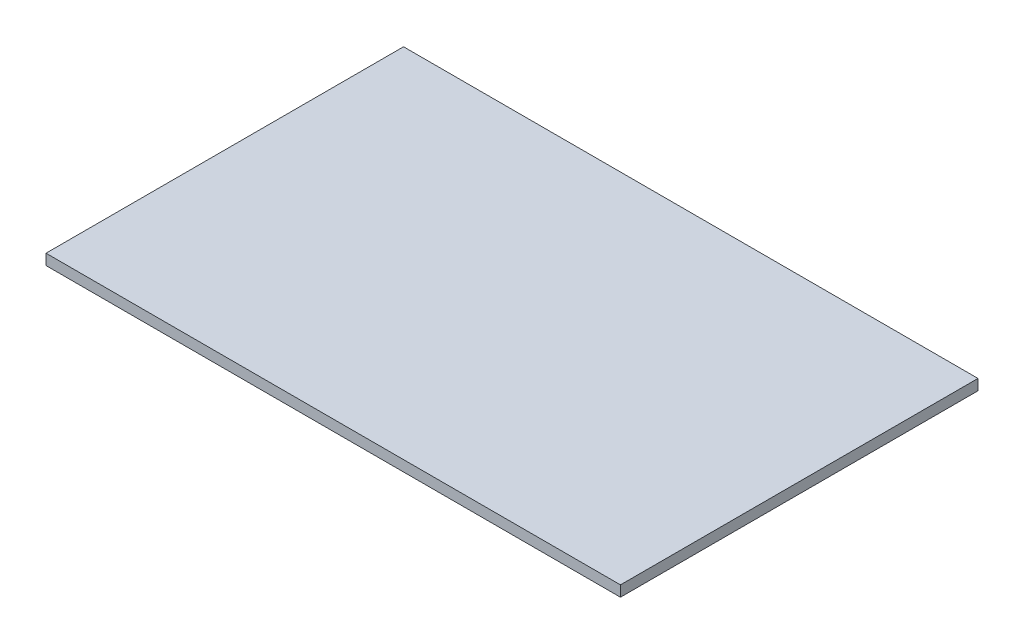
ISO-10303-21;
HEADER;
FILE_DESCRIPTION(('STEP AP214'),'2;1');
FILE_NAME('part.step','',(''),(''),'','','');
FILE_SCHEMA(('AUTOMOTIVE_DESIGN { 1 0 10303 214 1 1 1 1 }'));
ENDSEC;
DATA;
#1=APPLICATION_CONTEXT('core data for automotive mechanical design processes');
#2=APPLICATION_PROTOCOL_DEFINITION('international standard','automotive_design',2000,#1);
#3=PRODUCT_CONTEXT('',#1,'mechanical');
#4=PRODUCT('Part','Part','',(#3));
#5=PRODUCT_RELATED_PRODUCT_CATEGORY('part','',(#4));
#6=PRODUCT_DEFINITION_FORMATION('','',#4);
#7=PRODUCT_DEFINITION_CONTEXT('part definition',#1,'design');
#8=PRODUCT_DEFINITION('design','',#6,#7);
#9=PRODUCT_DEFINITION_SHAPE('','',#8);
#10=(LENGTH_UNIT() NAMED_UNIT(*) SI_UNIT(.MILLI.,.METRE.));
#11=(NAMED_UNIT(*) PLANE_ANGLE_UNIT() SI_UNIT($,.RADIAN.));
#12=(NAMED_UNIT(*) SI_UNIT($,.STERADIAN.) SOLID_ANGLE_UNIT());
#13=UNCERTAINTY_MEASURE_WITH_UNIT(LENGTH_MEASURE(1.E-05),#10,'distance_accuracy_value','');
#14=(GEOMETRIC_REPRESENTATION_CONTEXT(3) GLOBAL_UNCERTAINTY_ASSIGNED_CONTEXT((#13)) GLOBAL_UNIT_ASSIGNED_CONTEXT((#10,
#11,#12)) REPRESENTATION_CONTEXT('',''));
#15=CARTESIAN_POINT('',(0.,0.,0.));
#16=DIRECTION('',(0.,0.,1.));
#17=DIRECTION('',(1.,0.,0.));
#18=AXIS2_PLACEMENT_3D('',#15,#16,#17);
#19=CARTESIAN_POINT('',(0.,18.,0.));
#20=DIRECTION('',(1.,0.,0.));
#21=DIRECTION('',(0.,0.,-1.));
#22=AXIS2_PLACEMENT_3D('',#19,#20,#21);
#23=PLANE('',#22);
#24=DIRECTION('',(0.,0.,1.));
#25=VECTOR('',#24,1.);
#26=CARTESIAN_POINT('',(0.,0.,0.));
#27=LINE('',#26,#25);
#28=CARTESIAN_POINT('',(0.,0.,-600.));
#29=VERTEX_POINT('',#28);
#30=CARTESIAN_POINT('',(0.,0.,0.));
#31=VERTEX_POINT('',#30);
#32=EDGE_CURVE('E97',#29,#31,#27,.T.);
#33=ORIENTED_EDGE('',*,*,#32,.T.);
#34=DIRECTION('',(0.,-1.,0.));
#35=VECTOR('',#34,1.);
#36=CARTESIAN_POINT('',(0.,18.,0.));
#37=LINE('',#36,#35);
#38=CARTESIAN_POINT('',(0.,18.,0.));
#39=VERTEX_POINT('',#38);
#40=EDGE_CURVE('E11',#39,#31,#37,.T.);
#41=ORIENTED_EDGE('',*,*,#40,.F.);
#42=DIRECTION('',(0.,0.,1.));
#43=VECTOR('',#42,1.);
#44=CARTESIAN_POINT('',(0.,18.,0.));
#45=LINE('',#44,#43);
#46=CARTESIAN_POINT('',(0.,18.,-600.));
#47=VERTEX_POINT('',#46);
#48=EDGE_CURVE('E85',#47,#39,#45,.T.);
#49=ORIENTED_EDGE('',*,*,#48,.F.);
#50=DIRECTION('',(0.,-1.,0.));
#51=VECTOR('',#50,1.);
#52=CARTESIAN_POINT('',(0.,18.,-600.));
#53=LINE('',#52,#51);
#54=EDGE_CURVE('E93',#47,#29,#53,.T.);
#55=ORIENTED_EDGE('',*,*,#54,.T.);
#56=EDGE_LOOP('',(#33,#41,#49,#55));
#57=FACE_BOUND('',#56,.T.);
#58=ADVANCED_FACE('F34',(#57),#23,.F.);
#59=CARTESIAN_POINT('',(0.,18.,0.));
#60=DIRECTION('',(0.,0.,-1.));
#61=DIRECTION('',(-1.,0.,0.));
#62=AXIS2_PLACEMENT_3D('',#59,#60,#61);
#63=PLANE('',#62);
#64=DIRECTION('',(1.,0.,0.));
#65=VECTOR('',#64,1.);
#66=CARTESIAN_POINT('',(0.,0.,0.));
#67=LINE('',#66,#65);
#68=CARTESIAN_POINT('',(964.,0.,0.));
#69=VERTEX_POINT('',#68);
#70=EDGE_CURVE('E89',#31,#69,#67,.T.);
#71=ORIENTED_EDGE('',*,*,#70,.T.);
#72=DIRECTION('',(0.,-1.,0.));
#73=VECTOR('',#72,1.);
#74=CARTESIAN_POINT('',(964.,18.,0.));
#75=LINE('',#74,#73);
#76=CARTESIAN_POINT('',(964.,18.,0.));
#77=VERTEX_POINT('',#76);
#78=EDGE_CURVE('E42',#77,#69,#75,.T.);
#79=ORIENTED_EDGE('',*,*,#78,.F.);
#80=DIRECTION('',(1.,0.,0.));
#81=VECTOR('',#80,1.);
#82=CARTESIAN_POINT('',(0.,18.,0.));
#83=LINE('',#82,#81);
#84=EDGE_CURVE('E80',#39,#77,#83,.T.);
#85=ORIENTED_EDGE('',*,*,#84,.F.);
#86=ORIENTED_EDGE('',*,*,#40,.T.);
#87=EDGE_LOOP('',(#71,#79,#85,#86));
#88=FACE_BOUND('',#87,.T.);
#89=ADVANCED_FACE('F88',(#88),#63,.F.);
#90=CARTESIAN_POINT('',(964.,18.,0.));
#91=DIRECTION('',(-1.,0.,0.));
#92=DIRECTION('',(0.,0.,1.));
#93=AXIS2_PLACEMENT_3D('',#90,#91,#92);
#94=PLANE('',#93);
#95=DIRECTION('',(0.,0.,-1.));
#96=VECTOR('',#95,1.);
#97=CARTESIAN_POINT('',(964.,0.,0.));
#98=LINE('',#97,#96);
#99=CARTESIAN_POINT('',(964.,0.,-600.));
#100=VERTEX_POINT('',#99);
#101=EDGE_CURVE('E67',#69,#100,#98,.T.);
#102=ORIENTED_EDGE('',*,*,#101,.T.);
#103=DIRECTION('',(0.,-1.,0.));
#104=VECTOR('',#103,1.);
#105=CARTESIAN_POINT('',(964.,18.,-600.));
#106=LINE('',#105,#104);
#107=CARTESIAN_POINT('',(964.,18.,-600.));
#108=VERTEX_POINT('',#107);
#109=EDGE_CURVE('E90',#108,#100,#106,.T.);
#110=ORIENTED_EDGE('',*,*,#109,.F.);
#111=DIRECTION('',(0.,0.,-1.));
#112=VECTOR('',#111,1.);
#113=CARTESIAN_POINT('',(964.,18.,0.));
#114=LINE('',#113,#112);
#115=EDGE_CURVE('E83',#77,#108,#114,.T.);
#116=ORIENTED_EDGE('',*,*,#115,.F.);
#117=ORIENTED_EDGE('',*,*,#78,.T.);
#118=EDGE_LOOP('',(#102,#110,#116,#117));
#119=FACE_BOUND('',#118,.T.);
#120=ADVANCED_FACE('F91',(#119),#94,.F.);
#121=CARTESIAN_POINT('',(0.,18.,-600.));
#122=DIRECTION('',(0.,0.,1.));
#123=DIRECTION('',(1.,0.,0.));
#124=AXIS2_PLACEMENT_3D('',#121,#122,#123);
#125=PLANE('',#124);
#126=DIRECTION('',(-1.,0.,0.));
#127=VECTOR('',#126,1.);
#128=CARTESIAN_POINT('',(0.,0.,-600.));
#129=LINE('',#128,#127);
#130=EDGE_CURVE('E73',#100,#29,#129,.T.);
#131=ORIENTED_EDGE('',*,*,#130,.T.);
#132=ORIENTED_EDGE('',*,*,#54,.F.);
#133=DIRECTION('',(-1.,0.,0.));
#134=VECTOR('',#133,1.);
#135=CARTESIAN_POINT('',(0.,18.,-600.));
#136=LINE('',#135,#134);
#137=EDGE_CURVE('E50',#108,#47,#136,.T.);
#138=ORIENTED_EDGE('',*,*,#137,.F.);
#139=ORIENTED_EDGE('',*,*,#109,.T.);
#140=EDGE_LOOP('',(#131,#132,#138,#139));
#141=FACE_BOUND('',#140,.T.);
#142=ADVANCED_FACE('F104',(#141),#125,.F.);
#143=CARTESIAN_POINT('',(0.,18.,0.));
#144=DIRECTION('',(0.,-1.,0.));
#145=DIRECTION('',(0.,0.,-1.));
#146=AXIS2_PLACEMENT_3D('',#143,#144,#145);
#147=PLANE('',#146);
#148=ORIENTED_EDGE('',*,*,#48,.T.);
#149=ORIENTED_EDGE('',*,*,#84,.T.);
#150=ORIENTED_EDGE('',*,*,#115,.T.);
#151=ORIENTED_EDGE('',*,*,#137,.T.);
#152=EDGE_LOOP('',(#148,#149,#150,#151));
#153=FACE_BOUND('',#152,.T.);
#154=ADVANCED_FACE('F81',(#153),#147,.F.);
#155=CARTESIAN_POINT('',(0.,0.,0.));
#156=DIRECTION('',(0.,-1.,0.));
#157=DIRECTION('',(0.,0.,-1.));
#158=AXIS2_PLACEMENT_3D('',#155,#156,#157);
#159=PLANE('',#158);
#160=ORIENTED_EDGE('',*,*,#32,.F.);
#161=ORIENTED_EDGE('',*,*,#130,.F.);
#162=ORIENTED_EDGE('',*,*,#101,.F.);
#163=ORIENTED_EDGE('',*,*,#70,.F.);
#164=EDGE_LOOP('',(#160,#161,#162,#163));
#165=FACE_BOUND('',#164,.T.);
#166=ADVANCED_FACE('F107',(#165),#159,.T.);
#167=CLOSED_SHELL('',(#58,#89,#120,#142,#154,#166));
#168=MANIFOLD_SOLID_BREP('B2',#167);
#169=ADVANCED_BREP_SHAPE_REPRESENTATION('',(#18,#168),#14);
#170=SHAPE_DEFINITION_REPRESENTATION(#9,#169);
ENDSEC;
END-ISO-10303-21;
